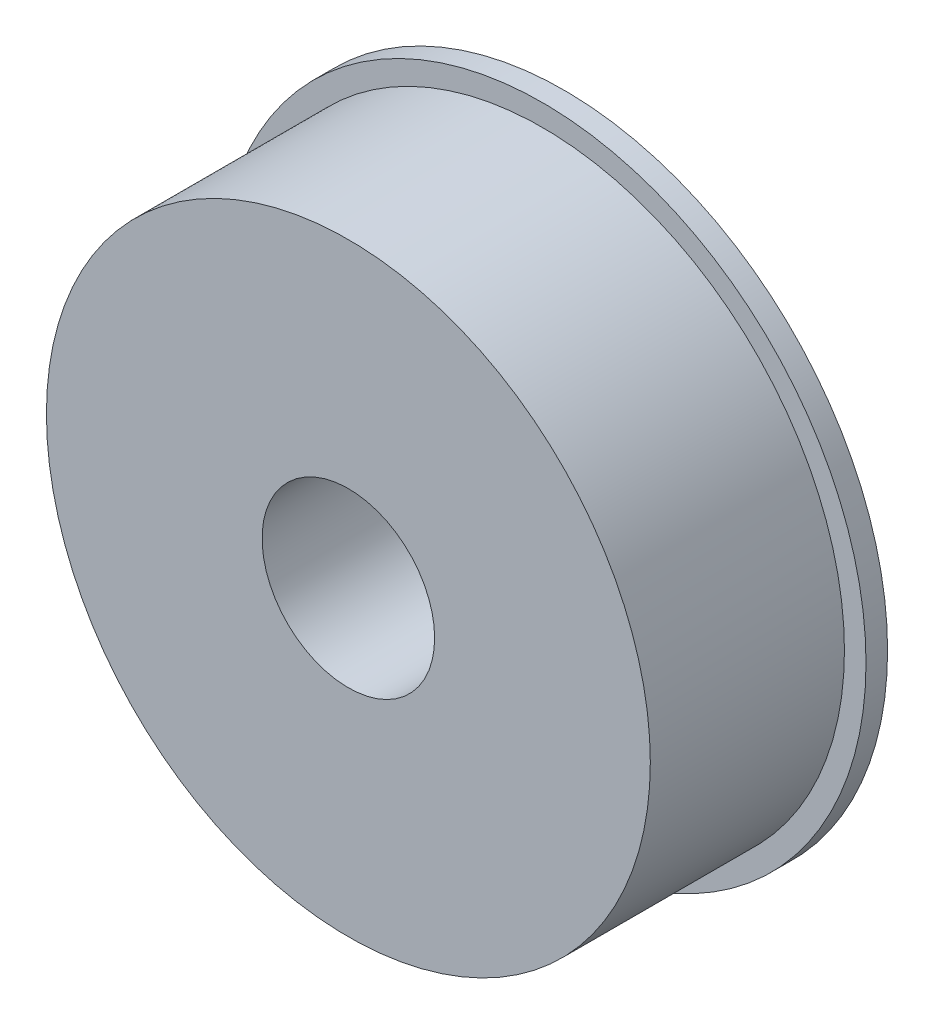
ISO-10303-21;
HEADER;
FILE_DESCRIPTION(('STEP AP214'),'2;1');
FILE_NAME('part.step','',(''),(''),'','','');
FILE_SCHEMA(('AUTOMOTIVE_DESIGN { 1 0 10303 214 1 1 1 1 }'));
ENDSEC;
DATA;
#1=APPLICATION_CONTEXT('core data for automotive mechanical design processes');
#2=APPLICATION_PROTOCOL_DEFINITION('international standard','automotive_design',2000,#1);
#3=PRODUCT_CONTEXT('',#1,'mechanical');
#4=PRODUCT('Part','Part','',(#3));
#5=PRODUCT_RELATED_PRODUCT_CATEGORY('part','',(#4));
#6=PRODUCT_DEFINITION_FORMATION('','',#4);
#7=PRODUCT_DEFINITION_CONTEXT('part definition',#1,'design');
#8=PRODUCT_DEFINITION('design','',#6,#7);
#9=PRODUCT_DEFINITION_SHAPE('','',#8);
#10=(LENGTH_UNIT() NAMED_UNIT(*) SI_UNIT(.MILLI.,.METRE.));
#11=(NAMED_UNIT(*) PLANE_ANGLE_UNIT() SI_UNIT($,.RADIAN.));
#12=(NAMED_UNIT(*) SI_UNIT($,.STERADIAN.) SOLID_ANGLE_UNIT());
#13=UNCERTAINTY_MEASURE_WITH_UNIT(LENGTH_MEASURE(1.E-05),#10,'distance_accuracy_value','');
#14=(GEOMETRIC_REPRESENTATION_CONTEXT(3) GLOBAL_UNCERTAINTY_ASSIGNED_CONTEXT((#13)) GLOBAL_UNIT_ASSIGNED_CONTEXT((#10,
#11,#12)) REPRESENTATION_CONTEXT('',''));
#15=CARTESIAN_POINT('',(0.,0.,0.));
#16=DIRECTION('',(0.,0.,1.));
#17=DIRECTION('',(1.,0.,0.));
#18=AXIS2_PLACEMENT_3D('',#15,#16,#17);
#19=CARTESIAN_POINT('',(0.,0.,62.5));
#20=DIRECTION('',(0.,0.,1.));
#21=DIRECTION('',(1.,0.,0.));
#22=AXIS2_PLACEMENT_3D('',#19,#20,#21);
#23=PLANE('',#22);
#24=CARTESIAN_POINT('',(0.,0.,62.5));
#25=DIRECTION('',(0.,0.,1.));
#26=DIRECTION('',(1.,0.,0.));
#27=AXIS2_PLACEMENT_3D('',#24,#25,#26);
#28=CIRCLE('',#27,87.5);
#29=CARTESIAN_POINT('',(87.5,0.,62.5));
#30=VERTEX_POINT('',#29);
#31=EDGE_CURVE('E38',#30,#30,#28,.T.);
#32=ORIENTED_EDGE('',*,*,#31,.T.);
#33=EDGE_LOOP('',(#32));
#34=FACE_BOUND('',#33,.T.);
#35=CARTESIAN_POINT('',(0.,0.,62.5));
#36=DIRECTION('',(0.,0.,1.));
#37=DIRECTION('',(1.,0.,0.));
#38=AXIS2_PLACEMENT_3D('',#35,#36,#37);
#39=CIRCLE('',#38,25.);
#40=CARTESIAN_POINT('',(25.,0.,62.5));
#41=VERTEX_POINT('',#40);
#42=EDGE_CURVE('E42',#41,#41,#39,.T.);
#43=ORIENTED_EDGE('',*,*,#42,.F.);
#44=EDGE_LOOP('',(#43));
#45=FACE_BOUND('',#44,.T.);
#46=ADVANCED_FACE('F31',(#34,#45),#23,.T.);
#47=CARTESIAN_POINT('',(0.,0.,62.5));
#48=DIRECTION('',(0.,0.,-1.));
#49=DIRECTION('',(-1.,0.,0.));
#50=AXIS2_PLACEMENT_3D('',#47,#48,#49);
#51=CYLINDRICAL_SURFACE('',#50,87.5);
#52=CARTESIAN_POINT('',(0.,0.,6.25));
#53=DIRECTION('',(0.,0.,1.));
#54=DIRECTION('',(1.,0.,0.));
#55=AXIS2_PLACEMENT_3D('',#52,#53,#54);
#56=CIRCLE('',#55,87.5);
#57=CARTESIAN_POINT('',(87.5,0.,6.25));
#58=VERTEX_POINT('',#57);
#59=EDGE_CURVE('E46',#58,#58,#56,.T.);
#60=ORIENTED_EDGE('',*,*,#59,.T.);
#61=EDGE_LOOP('',(#60));
#62=FACE_BOUND('',#61,.T.);
#63=ORIENTED_EDGE('',*,*,#31,.F.);
#64=EDGE_LOOP('',(#63));
#65=FACE_BOUND('',#64,.T.);
#66=ADVANCED_FACE('F33',(#62,#65),#51,.T.);
#67=CARTESIAN_POINT('',(0.,0.,62.5));
#68=DIRECTION('',(0.,0.,-1.));
#69=DIRECTION('',(-1.,0.,0.));
#70=AXIS2_PLACEMENT_3D('',#67,#68,#69);
#71=CYLINDRICAL_SURFACE('',#70,25.);
#72=CARTESIAN_POINT('',(0.,0.,6.25));
#73=DIRECTION('',(0.,0.,1.));
#74=DIRECTION('',(1.,0.,0.));
#75=AXIS2_PLACEMENT_3D('',#72,#73,#74);
#76=CIRCLE('',#75,25.);
#77=CARTESIAN_POINT('',(25.,0.,6.25));
#78=VERTEX_POINT('',#77);
#79=EDGE_CURVE('E10',#78,#78,#76,.T.);
#80=ORIENTED_EDGE('',*,*,#79,.F.);
#81=EDGE_LOOP('',(#80));
#82=FACE_BOUND('',#81,.T.);
#83=ORIENTED_EDGE('',*,*,#42,.T.);
#84=EDGE_LOOP('',(#83));
#85=FACE_BOUND('',#84,.T.);
#86=ADVANCED_FACE('F79',(#82,#85),#71,.F.);
#87=CARTESIAN_POINT('',(0.,0.,6.25));
#88=DIRECTION('',(0.,0.,1.));
#89=DIRECTION('',(1.,0.,0.));
#90=AXIS2_PLACEMENT_3D('',#87,#88,#89);
#91=PLANE('',#90);
#92=ORIENTED_EDGE('',*,*,#79,.T.);
#93=EDGE_LOOP('',(#92));
#94=FACE_BOUND('',#93,.T.);
#95=ADVANCED_FACE('F63',(#94),#91,.T.);
#96=CARTESIAN_POINT('',(0.,0.,6.25));
#97=DIRECTION('',(0.,0.,-1.));
#98=DIRECTION('',(-1.,0.,0.));
#99=AXIS2_PLACEMENT_3D('',#96,#97,#98);
#100=CYLINDRICAL_SURFACE('',#99,93.75);
#101=CARTESIAN_POINT('',(0.,0.,6.25));
#102=DIRECTION('',(0.,0.,1.));
#103=DIRECTION('',(1.,0.,0.));
#104=AXIS2_PLACEMENT_3D('',#101,#102,#103);
#105=CIRCLE('',#104,93.75);
#106=CARTESIAN_POINT('',(93.75,0.,6.25));
#107=VERTEX_POINT('',#106);
#108=EDGE_CURVE('E51',#107,#107,#105,.T.);
#109=ORIENTED_EDGE('',*,*,#108,.F.);
#110=EDGE_LOOP('',(#109));
#111=FACE_BOUND('',#110,.T.);
#112=CARTESIAN_POINT('',(0.,0.,0.));
#113=DIRECTION('',(0.,0.,1.));
#114=DIRECTION('',(1.,0.,0.));
#115=AXIS2_PLACEMENT_3D('',#112,#113,#114);
#116=CIRCLE('',#115,93.75);
#117=CARTESIAN_POINT('',(93.75,0.,0.));
#118=VERTEX_POINT('',#117);
#119=EDGE_CURVE('E52',#118,#118,#116,.T.);
#120=ORIENTED_EDGE('',*,*,#119,.T.);
#121=EDGE_LOOP('',(#120));
#122=FACE_BOUND('',#121,.T.);
#123=ADVANCED_FACE('F60',(#111,#122),#100,.T.);
#124=ORIENTED_EDGE('',*,*,#59,.F.);
#125=EDGE_LOOP('',(#124));
#126=FACE_BOUND('',#125,.T.);
#127=ORIENTED_EDGE('',*,*,#108,.T.);
#128=EDGE_LOOP('',(#127));
#129=FACE_BOUND('',#128,.T.);
#130=ADVANCED_FACE('F58',(#126,#129),#91,.T.);
#131=CARTESIAN_POINT('',(0.,0.,0.));
#132=DIRECTION('',(0.,0.,1.));
#133=DIRECTION('',(1.,0.,0.));
#134=AXIS2_PLACEMENT_3D('',#131,#132,#133);
#135=PLANE('',#134);
#136=ORIENTED_EDGE('',*,*,#119,.F.);
#137=EDGE_LOOP('',(#136));
#138=FACE_BOUND('',#137,.T.);
#139=ADVANCED_FACE('F67',(#138),#135,.F.);
#140=CLOSED_SHELL('',(#46,#66,#86,#95,#123,#130,#139));
#141=MANIFOLD_SOLID_BREP('B2',#140);
#142=ADVANCED_BREP_SHAPE_REPRESENTATION('',(#18,#141),#14);
#143=SHAPE_DEFINITION_REPRESENTATION(#9,#142);
ENDSEC;
END-ISO-10303-21;
